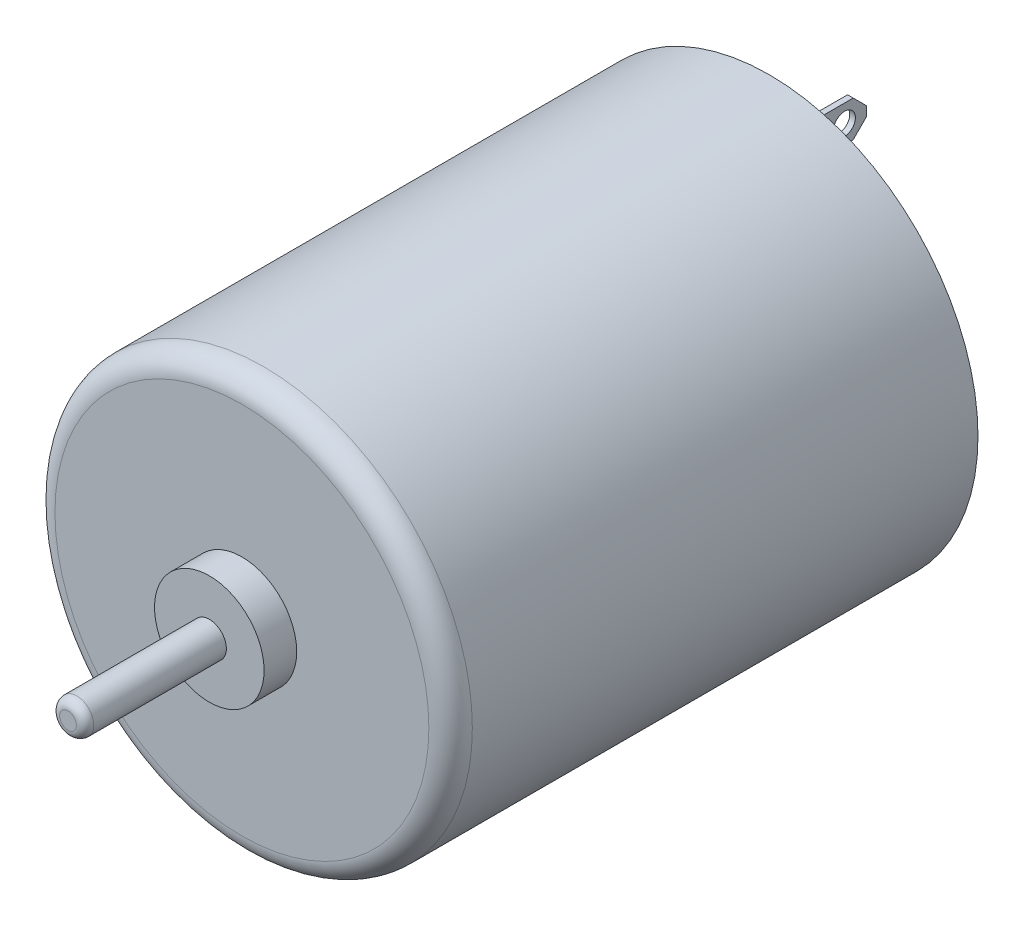
ISO-10303-21;
HEADER;
FILE_DESCRIPTION(('STEP AP214'),'2;1');
FILE_NAME('part.step','',(''),(''),'','','');
FILE_SCHEMA(('AUTOMOTIVE_DESIGN { 1 0 10303 214 1 1 1 1 }'));
ENDSEC;
DATA;
#1=APPLICATION_CONTEXT('core data for automotive mechanical design processes');
#2=APPLICATION_PROTOCOL_DEFINITION('international standard','automotive_design',2000,#1);
#3=PRODUCT_CONTEXT('',#1,'mechanical');
#4=PRODUCT('Part','Part','',(#3));
#5=PRODUCT_RELATED_PRODUCT_CATEGORY('part','',(#4));
#6=PRODUCT_DEFINITION_FORMATION('','',#4);
#7=PRODUCT_DEFINITION_CONTEXT('part definition',#1,'design');
#8=PRODUCT_DEFINITION('design','',#6,#7);
#9=PRODUCT_DEFINITION_SHAPE('','',#8);
#10=(LENGTH_UNIT() NAMED_UNIT(*) SI_UNIT(.MILLI.,.METRE.));
#11=(NAMED_UNIT(*) PLANE_ANGLE_UNIT() SI_UNIT($,.RADIAN.));
#12=(NAMED_UNIT(*) SI_UNIT($,.STERADIAN.) SOLID_ANGLE_UNIT());
#13=UNCERTAINTY_MEASURE_WITH_UNIT(LENGTH_MEASURE(1.E-05),#10,'distance_accuracy_value','');
#14=(GEOMETRIC_REPRESENTATION_CONTEXT(3) GLOBAL_UNCERTAINTY_ASSIGNED_CONTEXT((#13)) GLOBAL_UNIT_ASSIGNED_CONTEXT((#10,
#11,#12)) REPRESENTATION_CONTEXT('',''));
#15=CARTESIAN_POINT('',(0.,0.,0.));
#16=DIRECTION('',(0.,0.,1.));
#17=DIRECTION('',(1.,0.,0.));
#18=AXIS2_PLACEMENT_3D('',#15,#16,#17);
#19=CARTESIAN_POINT('',(1.52655665885959E-13,0.,1.01599999999996));
#20=DIRECTION('',(0.,0.,-1.));
#21=DIRECTION('',(-1.,0.,0.));
#22=AXIS2_PLACEMENT_3D('',#19,#20,#21);
#23=PLANE('',#22);
#24=CARTESIAN_POINT('',(1.52655665885959E-13,0.,1.01599999999996));
#25=DIRECTION('',(0.,0.,-1.));
#26=DIRECTION('',(-1.,0.,0.));
#27=AXIS2_PLACEMENT_3D('',#24,#25,#26);
#28=CIRCLE('',#27,3.2258);
#29=CARTESIAN_POINT('',(-3.22579999999985,0.,1.01599999999997));
#30=VERTEX_POINT('',#29);
#31=EDGE_CURVE('E218',#30,#30,#28,.T.);
#32=ORIENTED_EDGE('',*,*,#31,.F.);
#33=EDGE_LOOP('',(#32));
#34=FACE_BOUND('',#33,.T.);
#35=CARTESIAN_POINT('',(1.52655665885959E-13,0.,1.01599999999996));
#36=DIRECTION('',(0.,0.,-1.));
#37=DIRECTION('',(-1.,0.,0.));
#38=AXIS2_PLACEMENT_3D('',#35,#36,#37);
#39=CIRCLE('',#38,11.7094);
#40=CARTESIAN_POINT('',(-11.7093999999998,1.05728355061834E-13,1.01599999999998));
#41=VERTEX_POINT('',#40);
#42=EDGE_CURVE('E222',#41,#41,#39,.T.);
#43=ORIENTED_EDGE('',*,*,#42,.T.);
#44=EDGE_LOOP('',(#43));
#45=FACE_BOUND('',#44,.T.);
#46=DIRECTION('',(-1.,0.,0.));
#47=VECTOR('',#46,1.);
#48=CARTESIAN_POINT('',(-1.26999999999997,-10.1600000000003,1.01599999999977));
#49=LINE('',#48,#47);
#50=CARTESIAN_POINT('',(-1.26999999999997,-10.1600000000003,1.01599999999977));
#51=VERTEX_POINT('',#50);
#52=CARTESIAN_POINT('',(-1.60019999999997,-10.1600000000002,1.01599999999991));
#53=VERTEX_POINT('',#52);
#54=EDGE_CURVE('E203',#51,#53,#49,.T.);
#55=ORIENTED_EDGE('',*,*,#54,.F.);
#56=DIRECTION('',(0.,-1.,0.));
#57=VECTOR('',#56,1.);
#58=CARTESIAN_POINT('',(-1.2699999999997,-8.05180000000033,1.01599999999977));
#59=LINE('',#58,#57);
#60=CARTESIAN_POINT('',(-1.2699999999997,-8.05180000000033,1.01599999999977));
#61=VERTEX_POINT('',#60);
#62=EDGE_CURVE('E193',#61,#51,#59,.T.);
#63=ORIENTED_EDGE('',*,*,#62,.F.);
#64=DIRECTION('',(1.,0.,0.));
#65=VECTOR('',#64,1.);
#66=CARTESIAN_POINT('',(-1.2699999999997,-8.05180000000033,1.01599999999977));
#67=LINE('',#66,#65);
#68=CARTESIAN_POINT('',(-1.6001999999997,-8.05180000000022,1.01599999999993));
#69=VERTEX_POINT('',#68);
#70=EDGE_CURVE('E198',#69,#61,#67,.T.);
#71=ORIENTED_EDGE('',*,*,#70,.F.);
#72=DIRECTION('',(0.,1.,0.));
#73=VECTOR('',#72,1.);
#74=CARTESIAN_POINT('',(-1.6001999999997,-8.05180000000022,1.01599999999993));
#75=LINE('',#74,#73);
#76=EDGE_CURVE('E206',#53,#69,#75,.T.);
#77=ORIENTED_EDGE('',*,*,#76,.F.);
#78=EDGE_LOOP('',(#55,#63,#71,#77));
#79=FACE_BOUND('',#78,.T.);
#80=DIRECTION('',(1.,0.,0.));
#81=VECTOR('',#80,1.);
#82=CARTESIAN_POINT('',(1.27000000000016,10.1599999999999,1.01599999999982));
#83=LINE('',#82,#81);
#84=CARTESIAN_POINT('',(1.27000000000016,10.1599999999999,1.01599999999982));
#85=VERTEX_POINT('',#84);
#86=CARTESIAN_POINT('',(1.60020000000016,10.1599999999999,1.01599999999988));
#87=VERTEX_POINT('',#86);
#88=EDGE_CURVE('E158',#85,#87,#83,.T.);
#89=ORIENTED_EDGE('',*,*,#88,.F.);
#90=DIRECTION('',(0.,1.,0.));
#91=VECTOR('',#90,1.);
#92=CARTESIAN_POINT('',(1.27000000000002,8.05179999999991,1.01599999999999));
#93=LINE('',#92,#91);
#94=CARTESIAN_POINT('',(1.27000000000002,8.05179999999991,1.01599999999999));
#95=VERTEX_POINT('',#94);
#96=EDGE_CURVE('E156',#95,#85,#93,.T.);
#97=ORIENTED_EDGE('',*,*,#96,.F.);
#98=DIRECTION('',(-1.,0.,0.));
#99=VECTOR('',#98,1.);
#100=CARTESIAN_POINT('',(1.27000000000002,8.05179999999991,1.01599999999999));
#101=LINE('',#100,#99);
#102=CARTESIAN_POINT('',(1.60020000000002,8.05180000000001,1.01599999999996));
#103=VERTEX_POINT('',#102);
#104=EDGE_CURVE('E145',#103,#95,#101,.T.);
#105=ORIENTED_EDGE('',*,*,#104,.F.);
#106=DIRECTION('',(0.,-1.,0.));
#107=VECTOR('',#106,1.);
#108=CARTESIAN_POINT('',(1.60020000000002,8.05180000000001,1.01599999999996));
#109=LINE('',#108,#107);
#110=EDGE_CURVE('E150',#87,#103,#109,.T.);
#111=ORIENTED_EDGE('',*,*,#110,.F.);
#112=EDGE_LOOP('',(#89,#97,#105,#111));
#113=FACE_BOUND('',#112,.T.);
#114=ADVANCED_FACE('F36',(#34,#45,#79,#113),#23,.T.);
#115=CARTESIAN_POINT('',(-1.94289029309402E-13,-1.87350135405495E-13,30.8101999999999));
#116=DIRECTION('',(0.,0.,-1.));
#117=DIRECTION('',(-1.,0.,0.));
#118=AXIS2_PLACEMENT_3D('',#115,#116,#117);
#119=CYLINDRICAL_SURFACE('',#118,12.192);
#120=CARTESIAN_POINT('',(0.,-1.59594559789866E-13,29.5401999999998));
#121=DIRECTION('',(0.,0.,1.));
#122=DIRECTION('',(1.,0.,0.));
#123=AXIS2_PLACEMENT_3D('',#120,#121,#122);
#124=CIRCLE('',#123,12.192);
#125=CARTESIAN_POINT('',(12.192,-2.69680482630822E-13,29.5401999999998));
#126=VERTEX_POINT('',#125);
#127=EDGE_CURVE('E248',#126,#126,#124,.F.);
#128=ORIENTED_EDGE('',*,*,#127,.T.);
#129=EDGE_LOOP('',(#128));
#130=FACE_BOUND('',#129,.T.);
#131=CARTESIAN_POINT('',(0.,0.,0.));
#132=DIRECTION('',(0.,0.,1.));
#133=DIRECTION('',(1.,0.,0.));
#134=AXIS2_PLACEMENT_3D('',#131,#132,#133);
#135=CIRCLE('',#134,12.192);
#136=CARTESIAN_POINT('',(12.192,-1.10085922840956E-13,0.));
#137=VERTEX_POINT('',#136);
#138=EDGE_CURVE('E234',#137,#137,#135,.T.);
#139=ORIENTED_EDGE('',*,*,#138,.T.);
#140=EDGE_LOOP('',(#139));
#141=FACE_BOUND('',#140,.T.);
#142=ADVANCED_FACE('F269',(#130,#141),#119,.T.);
#143=CARTESIAN_POINT('',(-1.94289029309402E-13,-1.87350135405495E-13,30.8101999999999));
#144=DIRECTION('',(0.,0.,1.));
#145=DIRECTION('',(1.,0.,0.));
#146=AXIS2_PLACEMENT_3D('',#143,#144,#145);
#147=PLANE('',#146);
#148=CARTESIAN_POINT('',(-1.94289029309402E-13,-1.87350135405495E-13,30.8101999999999));
#149=DIRECTION('',(0.,0.,1.));
#150=DIRECTION('',(1.,0.,0.));
#151=AXIS2_PLACEMENT_3D('',#148,#149,#150);
#152=CIRCLE('',#151,10.922);
#153=CARTESIAN_POINT('',(10.9219999999998,-2.85968774617184E-13,30.8101999999999));
#154=VERTEX_POINT('',#153);
#155=EDGE_CURVE('E245',#154,#154,#152,.T.);
#156=ORIENTED_EDGE('',*,*,#155,.T.);
#157=EDGE_LOOP('',(#156));
#158=FACE_BOUND('',#157,.T.);
#159=CARTESIAN_POINT('',(-1.94289029309402E-13,-1.87350135405495E-13,30.8101999999999));
#160=DIRECTION('',(0.,0.,1.));
#161=DIRECTION('',(1.,0.,0.));
#162=AXIS2_PLACEMENT_3D('',#159,#160,#161);
#163=CIRCLE('',#162,3.2004);
#164=CARTESIAN_POINT('',(3.20039999999981,-2.16247690151246E-13,30.8101999999999));
#165=VERTEX_POINT('',#164);
#166=EDGE_CURVE('E225',#165,#165,#163,.T.);
#167=ORIENTED_EDGE('',*,*,#166,.F.);
#168=EDGE_LOOP('',(#167));
#169=FACE_BOUND('',#168,.T.);
#170=ADVANCED_FACE('F275',(#158,#169),#147,.T.);
#171=CARTESIAN_POINT('',(0.,0.,0.));
#172=DIRECTION('',(0.,0.,1.));
#173=DIRECTION('',(1.,0.,0.));
#174=AXIS2_PLACEMENT_3D('',#171,#172,#173);
#175=PLANE('',#174);
#176=CARTESIAN_POINT('',(0.,0.,0.));
#177=DIRECTION('',(0.,0.,-1.));
#178=DIRECTION('',(-1.,0.,0.));
#179=AXIS2_PLACEMENT_3D('',#176,#177,#178);
#180=CIRCLE('',#179,11.7094);
#181=CARTESIAN_POINT('',(-11.7094,1.05728355061834E-13,0.));
#182=VERTEX_POINT('',#181);
#183=EDGE_CURVE('E221',#182,#182,#180,.T.);
#184=ORIENTED_EDGE('',*,*,#183,.F.);
#185=EDGE_LOOP('',(#184));
#186=FACE_BOUND('',#185,.T.);
#187=ORIENTED_EDGE('',*,*,#138,.F.);
#188=EDGE_LOOP('',(#187));
#189=FACE_BOUND('',#188,.T.);
#190=ADVANCED_FACE('F295',(#186,#189),#175,.F.);
#191=CARTESIAN_POINT('',(-2.77555756156289E-13,-2.42861286636753E-13,32.7151999999996));
#192=DIRECTION('',(0.,0.,-1.));
#193=DIRECTION('',(-1.,0.,0.));
#194=AXIS2_PLACEMENT_3D('',#191,#192,#193);
#195=CYLINDRICAL_SURFACE('',#194,3.2004);
#196=CARTESIAN_POINT('',(-2.77555756156289E-13,-2.42861286636753E-13,32.7151999999996));
#197=DIRECTION('',(0.,0.,1.));
#198=DIRECTION('',(1.,0.,0.));
#199=AXIS2_PLACEMENT_3D('',#196,#197,#198);
#200=CIRCLE('',#199,3.2004);
#201=CARTESIAN_POINT('',(3.20039999999972,-2.71758841382504E-13,32.7151999999996));
#202=VERTEX_POINT('',#201);
#203=EDGE_CURVE('E228',#202,#202,#200,.T.);
#204=ORIENTED_EDGE('',*,*,#203,.F.);
#205=EDGE_LOOP('',(#204));
#206=FACE_BOUND('',#205,.T.);
#207=ORIENTED_EDGE('',*,*,#166,.T.);
#208=EDGE_LOOP('',(#207));
#209=FACE_BOUND('',#208,.T.);
#210=ADVANCED_FACE('F291',(#206,#209),#195,.T.);
#211=CARTESIAN_POINT('',(-2.77555756156289E-13,-2.42861286636753E-13,32.7151999999996));
#212=DIRECTION('',(0.,0.,1.));
#213=DIRECTION('',(1.,0.,0.));
#214=AXIS2_PLACEMENT_3D('',#211,#212,#213);
#215=PLANE('',#214);
#216=CARTESIAN_POINT('',(-2.77555756156289E-13,-2.42861286636753E-13,32.7151999999996));
#217=DIRECTION('',(0.,0.,1.));
#218=DIRECTION('',(1.,0.,0.));
#219=AXIS2_PLACEMENT_3D('',#216,#217,#218);
#220=CIRCLE('',#219,0.99695);
#221=CARTESIAN_POINT('',(0.996949999999722,-2.51863104285727E-13,32.7151999999996));
#222=VERTEX_POINT('',#221);
#223=EDGE_CURVE('E231',#222,#222,#220,.T.);
#224=ORIENTED_EDGE('',*,*,#223,.F.);
#225=EDGE_LOOP('',(#224));
#226=FACE_BOUND('',#225,.T.);
#227=ORIENTED_EDGE('',*,*,#203,.T.);
#228=EDGE_LOOP('',(#227));
#229=FACE_BOUND('',#228,.T.);
#230=ADVANCED_FACE('F287',(#226,#229),#215,.T.);
#231=CARTESIAN_POINT('',(0.,0.,40.9701999999999));
#232=DIRECTION('',(0.,0.,1.));
#233=DIRECTION('',(1.,0.,0.));
#234=AXIS2_PLACEMENT_3D('',#231,#232,#233);
#235=PLANE('',#234);
#236=CARTESIAN_POINT('',(0.,0.,40.9701999999999));
#237=DIRECTION('',(0.,0.,1.));
#238=DIRECTION('',(1.,0.,0.));
#239=AXIS2_PLACEMENT_3D('',#236,#237,#238);
#240=CIRCLE('',#239,0.48895);
#241=CARTESIAN_POINT('',(0.488950000000014,0.,40.9701999999999));
#242=VERTEX_POINT('',#241);
#243=EDGE_CURVE('E237',#242,#242,#240,.T.);
#244=ORIENTED_EDGE('',*,*,#243,.T.);
#245=EDGE_LOOP('',(#244));
#246=FACE_BOUND('',#245,.T.);
#247=ADVANCED_FACE('F290',(#246),#235,.T.);
#248=CARTESIAN_POINT('',(0.,0.,40.9701999999999));
#249=DIRECTION('',(0.,0.,-1.));
#250=DIRECTION('',(-1.,0.,0.));
#251=AXIS2_PLACEMENT_3D('',#248,#249,#250);
#252=CYLINDRICAL_SURFACE('',#251,0.99695);
#253=CARTESIAN_POINT('',(0.,-2.84494650060196E-13,40.4621999999996));
#254=DIRECTION('',(0.,0.,1.));
#255=DIRECTION('',(1.,0.,0.));
#256=AXIS2_PLACEMENT_3D('',#253,#254,#255);
#257=CIRCLE('',#256,0.99695);
#258=CARTESIAN_POINT('',(0.996950000000014,-2.9349646770917E-13,40.4621999999996));
#259=VERTEX_POINT('',#258);
#260=EDGE_CURVE('E242',#259,#259,#257,.F.);
#261=ORIENTED_EDGE('',*,*,#260,.T.);
#262=EDGE_LOOP('',(#261));
#263=FACE_BOUND('',#262,.T.);
#264=ORIENTED_EDGE('',*,*,#223,.T.);
#265=EDGE_LOOP('',(#264));
#266=FACE_BOUND('',#265,.T.);
#267=ADVANCED_FACE('F299',(#263,#266),#252,.T.);
#268=CARTESIAN_POINT('',(0.,-2.84494650060196E-13,40.4621999999996));
#269=DIRECTION('',(0.,0.,1.));
#270=DIRECTION('',(1.,0.,0.));
#271=AXIS2_PLACEMENT_3D('',#268,#269,#270);
#272=DEGENERATE_TOROIDAL_SURFACE('',#271,0.48895,0.508,.T.);
#273=ORIENTED_EDGE('',*,*,#260,.F.);
#274=EDGE_LOOP('',(#273));
#275=FACE_BOUND('',#274,.T.);
#276=ORIENTED_EDGE('',*,*,#243,.F.);
#277=EDGE_LOOP('',(#276));
#278=FACE_BOUND('',#277,.T.);
#279=ADVANCED_FACE('F303',(#275,#278),#272,.T.);
#280=CARTESIAN_POINT('',(0.,-1.59594559789866E-13,29.5401999999998));
#281=DIRECTION('',(0.,0.,1.));
#282=DIRECTION('',(1.,0.,0.));
#283=AXIS2_PLACEMENT_3D('',#280,#281,#282);
#284=TOROIDAL_SURFACE('',#283,10.922,1.27);
#285=ORIENTED_EDGE('',*,*,#127,.F.);
#286=EDGE_LOOP('',(#285));
#287=FACE_BOUND('',#286,.T.);
#288=ORIENTED_EDGE('',*,*,#155,.F.);
#289=EDGE_LOOP('',(#288));
#290=FACE_BOUND('',#289,.T.);
#291=ADVANCED_FACE('F285',(#287,#290),#284,.T.);
#292=CARTESIAN_POINT('',(1.52655665885959E-13,0.,1.01599999999996));
#293=DIRECTION('',(0.,0.,-1.));
#294=DIRECTION('',(-1.,0.,0.));
#295=AXIS2_PLACEMENT_3D('',#292,#293,#294);
#296=CYLINDRICAL_SURFACE('',#295,11.7094);
#297=ORIENTED_EDGE('',*,*,#42,.F.);
#298=EDGE_LOOP('',(#297));
#299=FACE_BOUND('',#298,.T.);
#300=ORIENTED_EDGE('',*,*,#183,.T.);
#301=EDGE_LOOP('',(#300));
#302=FACE_BOUND('',#301,.T.);
#303=ADVANCED_FACE('F282',(#299,#302),#296,.F.);
#304=CARTESIAN_POINT('',(2.35922392732846E-13,-2.15105711021124E-13,-1.77799999999985));
#305=DIRECTION('',(0.,0.,1.));
#306=DIRECTION('',(1.,0.,0.));
#307=AXIS2_PLACEMENT_3D('',#304,#305,#306);
#308=CYLINDRICAL_SURFACE('',#307,3.2258);
#309=CARTESIAN_POINT('',(1.80411241501588E-13,0.,-0.889000000000112));
#310=DIRECTION('',(0.,0.,-1.));
#311=DIRECTION('',(-1.,0.,0.));
#312=AXIS2_PLACEMENT_3D('',#309,#310,#311);
#313=CIRCLE('',#312,3.2258);
#314=CARTESIAN_POINT('',(-3.22579999999982,0.,-0.889000000000108));
#315=VERTEX_POINT('',#314);
#316=EDGE_CURVE('E11',#315,#315,#313,.F.);
#317=ORIENTED_EDGE('',*,*,#316,.T.);
#318=EDGE_LOOP('',(#317));
#319=FACE_BOUND('',#318,.T.);
#320=ORIENTED_EDGE('',*,*,#31,.T.);
#321=EDGE_LOOP('',(#320));
#322=FACE_BOUND('',#321,.T.);
#323=ADVANCED_FACE('F265',(#319,#322),#308,.T.);
#324=CARTESIAN_POINT('',(2.35922392732846E-13,-2.15105711021124E-13,-1.77799999999985));
#325=DIRECTION('',(0.,0.,-1.));
#326=DIRECTION('',(-1.,0.,0.));
#327=AXIS2_PLACEMENT_3D('',#324,#325,#326);
#328=PLANE('',#327);
#329=CARTESIAN_POINT('',(2.35922392732846E-13,-2.15105711021124E-13,-1.77799999999985));
#330=DIRECTION('',(0.,0.,-1.));
#331=DIRECTION('',(-1.,0.,0.));
#332=AXIS2_PLACEMENT_3D('',#329,#330,#331);
#333=CIRCLE('',#332,2.3368);
#334=CARTESIAN_POINT('',(-2.33679999999976,-1.94005909143274E-13,-1.77799999999985));
#335=VERTEX_POINT('',#334);
#336=EDGE_CURVE('E44',#335,#335,#333,.T.);
#337=ORIENTED_EDGE('',*,*,#336,.T.);
#338=EDGE_LOOP('',(#337));
#339=FACE_BOUND('',#338,.T.);
#340=ADVANCED_FACE('F253',(#339),#328,.T.);
#341=CARTESIAN_POINT('',(1.80411241501588E-13,0.,-0.889000000000112));
#342=DIRECTION('',(0.,0.,-1.));
#343=DIRECTION('',(-1.,0.,0.));
#344=AXIS2_PLACEMENT_3D('',#341,#342,#343);
#345=TOROIDAL_SURFACE('',#344,2.3368,0.889);
#346=ORIENTED_EDGE('',*,*,#316,.F.);
#347=EDGE_LOOP('',(#346));
#348=FACE_BOUND('',#347,.T.);
#349=ORIENTED_EDGE('',*,*,#336,.F.);
#350=EDGE_LOOP('',(#349));
#351=FACE_BOUND('',#350,.T.);
#352=ADVANCED_FACE('F38',(#348,#351),#345,.T.);
#353=CARTESIAN_POINT('',(-1.26999999999999,-8.05180000000015,-4.06400000000022));
#354=DIRECTION('',(-1.,0.,0.));
#355=DIRECTION('',(0.,-1.,0.));
#356=AXIS2_PLACEMENT_3D('',#353,#354,#355);
#357=PLANE('',#356);
#358=CARTESIAN_POINT('',(-1.26999999999999,-9.10590000000036,-2.79400000000024));
#359=DIRECTION('',(1.,0.,0.));
#360=DIRECTION('',(0.,1.,0.));
#361=AXIS2_PLACEMENT_3D('',#358,#359,#360);
#362=CIRCLE('',#361,0.635);
#363=CARTESIAN_POINT('',(-1.27,-8.47090000000036,-2.79400000000024));
#364=VERTEX_POINT('',#363);
#365=EDGE_CURVE('E169',#364,#364,#362,.T.);
#366=ORIENTED_EDGE('',*,*,#365,.F.);
#367=EDGE_LOOP('',(#366));
#368=FACE_BOUND('',#367,.T.);
#369=DIRECTION('',(0.,0.,1.));
#370=VECTOR('',#369,1.);
#371=CARTESIAN_POINT('',(-1.2699999999999,-10.1600000000001,-4.06400000000012));
#372=LINE('',#371,#370);
#373=CARTESIAN_POINT('',(-1.2699999999998,-10.1600000000004,-3.30200000000019));
#374=VERTEX_POINT('',#373);
#375=EDGE_CURVE('E216',#374,#51,#372,.T.);
#376=ORIENTED_EDGE('',*,*,#375,.F.);
#377=DIRECTION('',(0.,-0.707106781186548,0.707106781186547));
#378=VECTOR('',#377,1.);
#379=CARTESIAN_POINT('',(-1.26999999999984,-9.39800000000001,-4.06400000000001));
#380=LINE('',#379,#378);
#381=CARTESIAN_POINT('',(-1.26999999999984,-9.39800000000001,-4.06400000000001));
#382=VERTEX_POINT('',#381);
#383=EDGE_CURVE('E175',#382,#374,#380,.T.);
#384=ORIENTED_EDGE('',*,*,#383,.F.);
#385=DIRECTION('',(0.,-1.,0.));
#386=VECTOR('',#385,1.);
#387=CARTESIAN_POINT('',(-1.26999999999999,-8.05180000000015,-4.06400000000022));
#388=LINE('',#387,#386);
#389=CARTESIAN_POINT('',(-1.26999999999977,-8.81380000000022,-4.06400000000012));
#390=VERTEX_POINT('',#389);
#391=EDGE_CURVE('E194',#390,#382,#388,.T.);
#392=ORIENTED_EDGE('',*,*,#391,.F.);
#393=DIRECTION('',(0.,-0.707106781186548,-0.707106781186547));
#394=VECTOR('',#393,1.);
#395=CARTESIAN_POINT('',(-1.26999999999999,-8.05180000000028,-3.30200000000019));
#396=LINE('',#395,#394);
#397=CARTESIAN_POINT('',(-1.26999999999999,-8.05180000000028,-3.30200000000019));
#398=VERTEX_POINT('',#397);
#399=EDGE_CURVE('E184',#398,#390,#396,.T.);
#400=ORIENTED_EDGE('',*,*,#399,.F.);
#401=DIRECTION('',(0.,0.,1.));
#402=VECTOR('',#401,1.);
#403=CARTESIAN_POINT('',(-1.26999999999999,-8.05180000000015,-4.06400000000022));
#404=LINE('',#403,#402);
#405=EDGE_CURVE('E200',#398,#61,#404,.T.);
#406=ORIENTED_EDGE('',*,*,#405,.T.);
#407=ORIENTED_EDGE('',*,*,#62,.T.);
#408=EDGE_LOOP('',(#376,#384,#392,#400,#406,#407));
#409=FACE_BOUND('',#408,.T.);
#410=ADVANCED_FACE('F256',(#368,#409),#357,.F.);
#411=CARTESIAN_POINT('',(-1.2699999999999,-10.1600000000001,-4.06400000000012));
#412=DIRECTION('',(0.,1.,0.));
#413=DIRECTION('',(0.,0.,1.));
#414=AXIS2_PLACEMENT_3D('',#411,#412,#413);
#415=PLANE('',#414);
#416=DIRECTION('',(0.,0.,1.));
#417=VECTOR('',#416,1.);
#418=CARTESIAN_POINT('',(-1.6001999999999,-10.1600000000001,-4.06400000000021));
#419=LINE('',#418,#417);
#420=CARTESIAN_POINT('',(-1.6001999999998,-10.1600000000001,-3.30200000000008));
#421=VERTEX_POINT('',#420);
#422=EDGE_CURVE('E214',#421,#53,#419,.T.);
#423=ORIENTED_EDGE('',*,*,#422,.F.);
#424=DIRECTION('',(1.,0.,0.));
#425=VECTOR('',#424,1.);
#426=CARTESIAN_POINT('',(-12.1929999999997,-10.1600000000001,-3.30200000000008));
#427=LINE('',#426,#425);
#428=EDGE_CURVE('E178',#421,#374,#427,.T.);
#429=ORIENTED_EDGE('',*,*,#428,.T.);
#430=ORIENTED_EDGE('',*,*,#375,.T.);
#431=ORIENTED_EDGE('',*,*,#54,.T.);
#432=EDGE_LOOP('',(#423,#429,#430,#431));
#433=FACE_BOUND('',#432,.T.);
#434=ADVANCED_FACE('F262',(#433),#415,.F.);
#435=CARTESIAN_POINT('',(-1.6002,-8.05180000000015,-4.06400000000021));
#436=DIRECTION('',(1.,0.,0.));
#437=DIRECTION('',(0.,1.,0.));
#438=AXIS2_PLACEMENT_3D('',#435,#436,#437);
#439=PLANE('',#438);
#440=CARTESIAN_POINT('',(-1.6002,-9.10590000000024,-2.79400000000002));
#441=DIRECTION('',(1.,0.,0.));
#442=DIRECTION('',(0.,1.,0.));
#443=AXIS2_PLACEMENT_3D('',#440,#441,#442);
#444=CIRCLE('',#443,0.635);
#445=CARTESIAN_POINT('',(-1.6002,-8.47090000000024,-2.79400000000002));
#446=VERTEX_POINT('',#445);
#447=EDGE_CURVE('E172',#446,#446,#444,.F.);
#448=ORIENTED_EDGE('',*,*,#447,.F.);
#449=EDGE_LOOP('',(#448));
#450=FACE_BOUND('',#449,.T.);
#451=DIRECTION('',(0.,1.,0.));
#452=VECTOR('',#451,1.);
#453=CARTESIAN_POINT('',(-1.6002,-8.05180000000015,-4.06400000000021));
#454=LINE('',#453,#452);
#455=CARTESIAN_POINT('',(-1.60019999999984,-9.39800000000007,-4.06400000000001));
#456=VERTEX_POINT('',#455);
#457=CARTESIAN_POINT('',(-1.60019999999977,-8.81380000000022,-4.06399999999993));
#458=VERTEX_POINT('',#457);
#459=EDGE_CURVE('E197',#456,#458,#454,.T.);
#460=ORIENTED_EDGE('',*,*,#459,.F.);
#461=DIRECTION('',(0.,0.707106781186548,-0.707106781186547));
#462=VECTOR('',#461,1.);
#463=CARTESIAN_POINT('',(-1.60019999999984,-9.39800000000007,-4.06400000000001));
#464=LINE('',#463,#462);
#465=EDGE_CURVE('E181',#421,#456,#464,.T.);
#466=ORIENTED_EDGE('',*,*,#465,.F.);
#467=ORIENTED_EDGE('',*,*,#422,.T.);
#468=ORIENTED_EDGE('',*,*,#76,.T.);
#469=DIRECTION('',(0.,0.,1.));
#470=VECTOR('',#469,1.);
#471=CARTESIAN_POINT('',(-1.6002,-8.05180000000015,-4.06400000000021));
#472=LINE('',#471,#470);
#473=CARTESIAN_POINT('',(-1.6002,-8.0518,-3.302));
#474=VERTEX_POINT('',#473);
#475=EDGE_CURVE('E212',#474,#69,#472,.T.);
#476=ORIENTED_EDGE('',*,*,#475,.F.);
#477=DIRECTION('',(0.,0.707106781186548,0.707106781186547));
#478=VECTOR('',#477,1.);
#479=CARTESIAN_POINT('',(-1.6002,-8.0518,-3.302));
#480=LINE('',#479,#478);
#481=EDGE_CURVE('E190',#458,#474,#480,.T.);
#482=ORIENTED_EDGE('',*,*,#481,.F.);
#483=EDGE_LOOP('',(#460,#466,#467,#468,#476,#482));
#484=FACE_BOUND('',#483,.T.);
#485=ADVANCED_FACE('F355',(#450,#484),#439,.F.);
#486=CARTESIAN_POINT('',(-1.26999999999999,-8.05180000000015,-4.06400000000022));
#487=DIRECTION('',(0.,-1.,0.));
#488=DIRECTION('',(0.,0.,-1.));
#489=AXIS2_PLACEMENT_3D('',#486,#487,#488);
#490=PLANE('',#489);
#491=ORIENTED_EDGE('',*,*,#405,.F.);
#492=DIRECTION('',(1.,0.,0.));
#493=VECTOR('',#492,1.);
#494=CARTESIAN_POINT('',(-12.193,-8.05179999999999,-3.30200000000003));
#495=LINE('',#494,#493);
#496=EDGE_CURVE('E186',#474,#398,#495,.T.);
#497=ORIENTED_EDGE('',*,*,#496,.F.);
#498=ORIENTED_EDGE('',*,*,#475,.T.);
#499=ORIENTED_EDGE('',*,*,#70,.T.);
#500=EDGE_LOOP('',(#491,#497,#498,#499));
#501=FACE_BOUND('',#500,.T.);
#502=ADVANCED_FACE('F363',(#501),#490,.F.);
#503=CARTESIAN_POINT('',(0.,-1.38777878078145E-13,-4.06399999999993));
#504=DIRECTION('',(0.,0.,-1.));
#505=DIRECTION('',(-1.,0.,0.));
#506=AXIS2_PLACEMENT_3D('',#503,#504,#505);
#507=PLANE('',#506);
#508=DIRECTION('',(1.,0.,0.));
#509=VECTOR('',#508,1.);
#510=CARTESIAN_POINT('',(-12.1929999999998,-9.3980000000002,-4.06400000000007));
#511=LINE('',#510,#509);
#512=EDGE_CURVE('E177',#456,#382,#511,.T.);
#513=ORIENTED_EDGE('',*,*,#512,.F.);
#514=ORIENTED_EDGE('',*,*,#459,.T.);
#515=DIRECTION('',(1.,0.,0.));
#516=VECTOR('',#515,1.);
#517=CARTESIAN_POINT('',(-12.1929999999998,-8.81380000000011,-4.06400000000001));
#518=LINE('',#517,#516);
#519=EDGE_CURVE('E187',#458,#390,#518,.T.);
#520=ORIENTED_EDGE('',*,*,#519,.T.);
#521=ORIENTED_EDGE('',*,*,#391,.T.);
#522=EDGE_LOOP('',(#513,#514,#520,#521));
#523=FACE_BOUND('',#522,.T.);
#524=ADVANCED_FACE('F371',(#523),#507,.T.);
#525=CARTESIAN_POINT('',(-12.193,-8.05179999999999,-3.30200000000003));
#526=DIRECTION('',(0.,-0.707106781186548,0.707106781186547));
#527=DIRECTION('',(0.,-0.707106781186548,-0.707106781186547));
#528=AXIS2_PLACEMENT_3D('',#525,#526,#527);
#529=PLANE('',#528);
#530=ORIENTED_EDGE('',*,*,#481,.T.);
#531=ORIENTED_EDGE('',*,*,#496,.T.);
#532=ORIENTED_EDGE('',*,*,#399,.T.);
#533=ORIENTED_EDGE('',*,*,#519,.F.);
#534=EDGE_LOOP('',(#530,#531,#532,#533));
#535=FACE_BOUND('',#534,.T.);
#536=ADVANCED_FACE('F379',(#535),#529,.F.);
#537=CARTESIAN_POINT('',(-12.1929999999998,-9.3980000000002,-4.06400000000007));
#538=DIRECTION('',(0.,0.707106781186549,0.707106781186548));
#539=DIRECTION('',(0.,-0.707106781186548,0.707106781186547));
#540=AXIS2_PLACEMENT_3D('',#537,#538,#539);
#541=PLANE('',#540);
#542=ORIENTED_EDGE('',*,*,#465,.T.);
#543=ORIENTED_EDGE('',*,*,#512,.T.);
#544=ORIENTED_EDGE('',*,*,#383,.T.);
#545=ORIENTED_EDGE('',*,*,#428,.F.);
#546=EDGE_LOOP('',(#542,#543,#544,#545));
#547=FACE_BOUND('',#546,.T.);
#548=ADVANCED_FACE('F387',(#547),#541,.F.);
#549=CARTESIAN_POINT('',(-12.193,-9.10590000000037,-2.79400000000019));
#550=DIRECTION('',(1.,0.,0.));
#551=DIRECTION('',(0.,1.,0.));
#552=AXIS2_PLACEMENT_3D('',#549,#550,#551);
#553=CYLINDRICAL_SURFACE('',#552,0.635);
#554=ORIENTED_EDGE('',*,*,#365,.T.);
#555=EDGE_LOOP('',(#554));
#556=FACE_BOUND('',#555,.T.);
#557=ORIENTED_EDGE('',*,*,#447,.T.);
#558=EDGE_LOOP('',(#557));
#559=FACE_BOUND('',#558,.T.);
#560=ADVANCED_FACE('F395',(#556,#559),#553,.F.);
#561=CARTESIAN_POINT('',(1.26999999999985,8.0517999999998,-4.06400000000007));
#562=DIRECTION('',(1.,0.,0.));
#563=DIRECTION('',(0.,1.,0.));
#564=AXIS2_PLACEMENT_3D('',#561,#562,#563);
#565=PLANE('',#564);
#566=CARTESIAN_POINT('',(1.26999999999979,9.1058999999999,-2.79400000000007));
#567=DIRECTION('',(-1.,0.,0.));
#568=DIRECTION('',(0.,-1.,0.));
#569=AXIS2_PLACEMENT_3D('',#566,#567,#568);
#570=CIRCLE('',#569,0.635);
#571=CARTESIAN_POINT('',(1.26999999999979,8.4708999999999,-2.79400000000007));
#572=VERTEX_POINT('',#571);
#573=EDGE_CURVE('E468',#572,#572,#570,.T.);
#574=ORIENTED_EDGE('',*,*,#573,.F.);
#575=EDGE_LOOP('',(#574));
#576=FACE_BOUND('',#575,.T.);
#577=DIRECTION('',(0.,0.,1.));
#578=VECTOR('',#577,1.);
#579=CARTESIAN_POINT('',(1.26999999999992,10.1599999999999,-4.06400000000007));
#580=LINE('',#579,#578);
#581=CARTESIAN_POINT('',(1.27000000000001,10.16,-3.30200000000019));
#582=VERTEX_POINT('',#581);
#583=EDGE_CURVE('E139',#582,#85,#580,.T.);
#584=ORIENTED_EDGE('',*,*,#583,.F.);
#585=DIRECTION('',(0.,0.707106781186548,0.707106781186547));
#586=VECTOR('',#585,1.);
#587=CARTESIAN_POINT('',(1.26999999999987,9.3979999999997,-4.06399999999991));
#588=LINE('',#587,#586);
#589=CARTESIAN_POINT('',(1.26999999999987,9.3979999999997,-4.06399999999991));
#590=VERTEX_POINT('',#589);
#591=EDGE_CURVE('E126',#590,#582,#588,.T.);
#592=ORIENTED_EDGE('',*,*,#591,.F.);
#593=DIRECTION('',(0.,1.,0.));
#594=VECTOR('',#593,1.);
#595=CARTESIAN_POINT('',(1.26999999999985,8.0517999999998,-4.06400000000007));
#596=LINE('',#595,#594);
#597=CARTESIAN_POINT('',(1.27000000000002,8.8137999999999,-4.06399999999996));
#598=VERTEX_POINT('',#597);
#599=EDGE_CURVE('E137',#598,#590,#596,.T.);
#600=ORIENTED_EDGE('',*,*,#599,.F.);
#601=DIRECTION('',(0.,0.707106781186548,-0.707106781186547));
#602=VECTOR('',#601,1.);
#603=CARTESIAN_POINT('',(1.27000000000005,8.05179999999988,-3.30200000000003));
#604=LINE('',#603,#602);
#605=CARTESIAN_POINT('',(1.27000000000005,8.05179999999988,-3.30200000000003));
#606=VERTEX_POINT('',#605);
#607=EDGE_CURVE('E59',#606,#598,#604,.T.);
#608=ORIENTED_EDGE('',*,*,#607,.F.);
#609=DIRECTION('',(0.,0.,1.));
#610=VECTOR('',#609,1.);
#611=CARTESIAN_POINT('',(1.26999999999985,8.0517999999998,-4.06400000000007));
#612=LINE('',#611,#610);
#613=EDGE_CURVE('E147',#606,#95,#612,.T.);
#614=ORIENTED_EDGE('',*,*,#613,.T.);
#615=ORIENTED_EDGE('',*,*,#96,.T.);
#616=EDGE_LOOP('',(#584,#592,#600,#608,#614,#615));
#617=FACE_BOUND('',#616,.T.);
#618=ADVANCED_FACE('F136',(#576,#617),#565,.F.);
#619=CARTESIAN_POINT('',(1.26999999999992,10.1599999999999,-4.06400000000007));
#620=DIRECTION('',(0.,-1.,0.));
#621=DIRECTION('',(0.,0.,-1.));
#622=AXIS2_PLACEMENT_3D('',#619,#620,#621);
#623=PLANE('',#622);
#624=DIRECTION('',(0.,0.,1.));
#625=VECTOR('',#624,1.);
#626=CARTESIAN_POINT('',(1.60019999999993,10.1599999999999,-4.06400000000007));
#627=LINE('',#626,#625);
#628=CARTESIAN_POINT('',(1.60020000000001,10.1599999999999,-3.30200000000008));
#629=VERTEX_POINT('',#628);
#630=EDGE_CURVE('E166',#629,#87,#627,.T.);
#631=ORIENTED_EDGE('',*,*,#630,.F.);
#632=DIRECTION('',(-1.,0.,0.));
#633=VECTOR('',#632,1.);
#634=CARTESIAN_POINT('',(12.1930000000001,10.1599999999999,-3.30200000000003));
#635=LINE('',#634,#633);
#636=EDGE_CURVE('E131',#629,#582,#635,.T.);
#637=ORIENTED_EDGE('',*,*,#636,.T.);
#638=ORIENTED_EDGE('',*,*,#583,.T.);
#639=ORIENTED_EDGE('',*,*,#88,.T.);
#640=EDGE_LOOP('',(#631,#637,#638,#639));
#641=FACE_BOUND('',#640,.T.);
#642=ADVANCED_FACE('F412',(#641),#623,.F.);
#643=CARTESIAN_POINT('',(1.60019999999986,8.05179999999988,-4.06400000000007));
#644=DIRECTION('',(-1.,0.,0.));
#645=DIRECTION('',(0.,-1.,0.));
#646=AXIS2_PLACEMENT_3D('',#643,#644,#645);
#647=PLANE('',#646);
#648=CARTESIAN_POINT('',(1.60019999999979,9.10589999999998,-2.79400000000003));
#649=DIRECTION('',(-1.,0.,0.));
#650=DIRECTION('',(0.,-1.,0.));
#651=AXIS2_PLACEMENT_3D('',#648,#649,#650);
#652=CIRCLE('',#651,0.635);
#653=CARTESIAN_POINT('',(1.60019999999979,8.47089999999998,-2.79400000000003));
#654=VERTEX_POINT('',#653);
#655=EDGE_CURVE('E140',#654,#654,#652,.F.);
#656=ORIENTED_EDGE('',*,*,#655,.F.);
#657=EDGE_LOOP('',(#656));
#658=FACE_BOUND('',#657,.T.);
#659=DIRECTION('',(0.,-1.,0.));
#660=VECTOR('',#659,1.);
#661=CARTESIAN_POINT('',(1.60019999999986,8.05179999999988,-4.06400000000007));
#662=LINE('',#661,#660);
#663=CARTESIAN_POINT('',(1.60019999999986,9.39799999999999,-4.06400000000001));
#664=VERTEX_POINT('',#663);
#665=CARTESIAN_POINT('',(1.60020000000002,8.81380000000001,-4.06400000000003));
#666=VERTEX_POINT('',#665);
#667=EDGE_CURVE('E144',#664,#666,#662,.T.);
#668=ORIENTED_EDGE('',*,*,#667,.F.);
#669=DIRECTION('',(0.,-0.707106781186548,-0.707106781186547));
#670=VECTOR('',#669,1.);
#671=CARTESIAN_POINT('',(1.60019999999986,9.39799999999999,-4.06400000000001));
#672=LINE('',#671,#670);
#673=EDGE_CURVE('E51',#629,#664,#672,.T.);
#674=ORIENTED_EDGE('',*,*,#673,.F.);
#675=ORIENTED_EDGE('',*,*,#630,.T.);
#676=ORIENTED_EDGE('',*,*,#110,.T.);
#677=DIRECTION('',(0.,0.,1.));
#678=VECTOR('',#677,1.);
#679=CARTESIAN_POINT('',(1.60019999999986,8.05179999999988,-4.06400000000007));
#680=LINE('',#679,#678);
#681=CARTESIAN_POINT('',(1.60020000000004,8.05179999999993,-3.30200000000015));
#682=VERTEX_POINT('',#681);
#683=EDGE_CURVE('E164',#682,#103,#680,.T.);
#684=ORIENTED_EDGE('',*,*,#683,.F.);
#685=DIRECTION('',(0.,-0.707106781186548,0.707106781186547));
#686=VECTOR('',#685,1.);
#687=CARTESIAN_POINT('',(1.60020000000004,8.05179999999993,-3.30200000000015));
#688=LINE('',#687,#686);
#689=EDGE_CURVE('E153',#666,#682,#688,.T.);
#690=ORIENTED_EDGE('',*,*,#689,.F.);
#691=EDGE_LOOP('',(#668,#674,#675,#676,#684,#690));
#692=FACE_BOUND('',#691,.T.);
#693=ADVANCED_FACE('F420',(#658,#692),#647,.F.);
#694=CARTESIAN_POINT('',(1.26999999999985,8.0517999999998,-4.06400000000007));
#695=DIRECTION('',(0.,1.,0.));
#696=DIRECTION('',(0.,0.,1.));
#697=AXIS2_PLACEMENT_3D('',#694,#695,#696);
#698=PLANE('',#697);
#699=ORIENTED_EDGE('',*,*,#613,.F.);
#700=DIRECTION('',(-1.,0.,0.));
#701=VECTOR('',#700,1.);
#702=CARTESIAN_POINT('',(12.193,8.05179999999957,-3.30200000000022));
#703=LINE('',#702,#701);
#704=EDGE_CURVE('E477',#682,#606,#703,.T.);
#705=ORIENTED_EDGE('',*,*,#704,.F.);
#706=ORIENTED_EDGE('',*,*,#683,.T.);
#707=ORIENTED_EDGE('',*,*,#104,.T.);
#708=EDGE_LOOP('',(#699,#705,#706,#707));
#709=FACE_BOUND('',#708,.T.);
#710=ADVANCED_FACE('F428',(#709),#698,.F.);
#711=CARTESIAN_POINT('',(0.,-1.38777878078145E-13,-4.06399999999993));
#712=DIRECTION('',(0.,0.,-1.));
#713=DIRECTION('',(1.,0.,0.));
#714=AXIS2_PLACEMENT_3D('',#711,#712,#713);
#715=PLANE('',#714);
#716=DIRECTION('',(-1.,0.,0.));
#717=VECTOR('',#716,1.);
#718=CARTESIAN_POINT('',(12.193,9.39799999999963,-4.06400000000015));
#719=LINE('',#718,#717);
#720=EDGE_CURVE('E123',#664,#590,#719,.T.);
#721=ORIENTED_EDGE('',*,*,#720,.F.);
#722=ORIENTED_EDGE('',*,*,#667,.T.);
#723=DIRECTION('',(-1.,0.,0.));
#724=VECTOR('',#723,1.);
#725=CARTESIAN_POINT('',(12.1929999999999,8.81379999999958,-4.06400000000012));
#726=LINE('',#725,#724);
#727=EDGE_CURVE('E143',#666,#598,#726,.T.);
#728=ORIENTED_EDGE('',*,*,#727,.T.);
#729=ORIENTED_EDGE('',*,*,#599,.T.);
#730=EDGE_LOOP('',(#721,#722,#728,#729));
#731=FACE_BOUND('',#730,.T.);
#732=ADVANCED_FACE('F142',(#731),#715,.T.);
#733=CARTESIAN_POINT('',(12.193,8.05179999999957,-3.30200000000022));
#734=DIRECTION('',(0.,0.707106781186549,0.707106781186548));
#735=DIRECTION('',(0.,-0.707106781186548,0.707106781186547));
#736=AXIS2_PLACEMENT_3D('',#733,#734,#735);
#737=PLANE('',#736);
#738=ORIENTED_EDGE('',*,*,#689,.T.);
#739=ORIENTED_EDGE('',*,*,#704,.T.);
#740=ORIENTED_EDGE('',*,*,#607,.T.);
#741=ORIENTED_EDGE('',*,*,#727,.F.);
#742=EDGE_LOOP('',(#738,#739,#740,#741));
#743=FACE_BOUND('',#742,.T.);
#744=ADVANCED_FACE('F443',(#743),#737,.F.);
#745=CARTESIAN_POINT('',(12.193,9.39799999999963,-4.06400000000015));
#746=DIRECTION('',(0.,-0.707106781186548,0.707106781186547));
#747=DIRECTION('',(0.,-0.707106781186548,-0.707106781186547));
#748=AXIS2_PLACEMENT_3D('',#745,#746,#747);
#749=PLANE('',#748);
#750=ORIENTED_EDGE('',*,*,#673,.T.);
#751=ORIENTED_EDGE('',*,*,#720,.T.);
#752=ORIENTED_EDGE('',*,*,#591,.T.);
#753=ORIENTED_EDGE('',*,*,#636,.F.);
#754=EDGE_LOOP('',(#750,#751,#752,#753));
#755=FACE_BOUND('',#754,.T.);
#756=ADVANCED_FACE('F125',(#755),#749,.F.);
#757=CARTESIAN_POINT('',(12.1929999999999,9.10589999999959,-2.79400000000019));
#758=DIRECTION('',(-1.,0.,0.));
#759=DIRECTION('',(0.,-1.,0.));
#760=AXIS2_PLACEMENT_3D('',#757,#758,#759);
#761=CYLINDRICAL_SURFACE('',#760,0.635);
#762=ORIENTED_EDGE('',*,*,#573,.T.);
#763=EDGE_LOOP('',(#762));
#764=FACE_BOUND('',#763,.T.);
#765=ORIENTED_EDGE('',*,*,#655,.T.);
#766=EDGE_LOOP('',(#765));
#767=FACE_BOUND('',#766,.T.);
#768=ADVANCED_FACE('F456',(#764,#767),#761,.F.);
#769=CLOSED_SHELL('',(#114,#142,#170,#190,#210,#230,#247,#267,#279,#291,#303,#323,#340,#352,
#410,#434,#485,#502,#524,#536,#548,#560,#618,#642,#693,#710,#732,#744,#756,#768));
#770=MANIFOLD_SOLID_BREP('B2',#769);
#771=ADVANCED_BREP_SHAPE_REPRESENTATION('',(#18,#770),#14);
#772=SHAPE_DEFINITION_REPRESENTATION(#9,#771);
ENDSEC;
END-ISO-10303-21;
